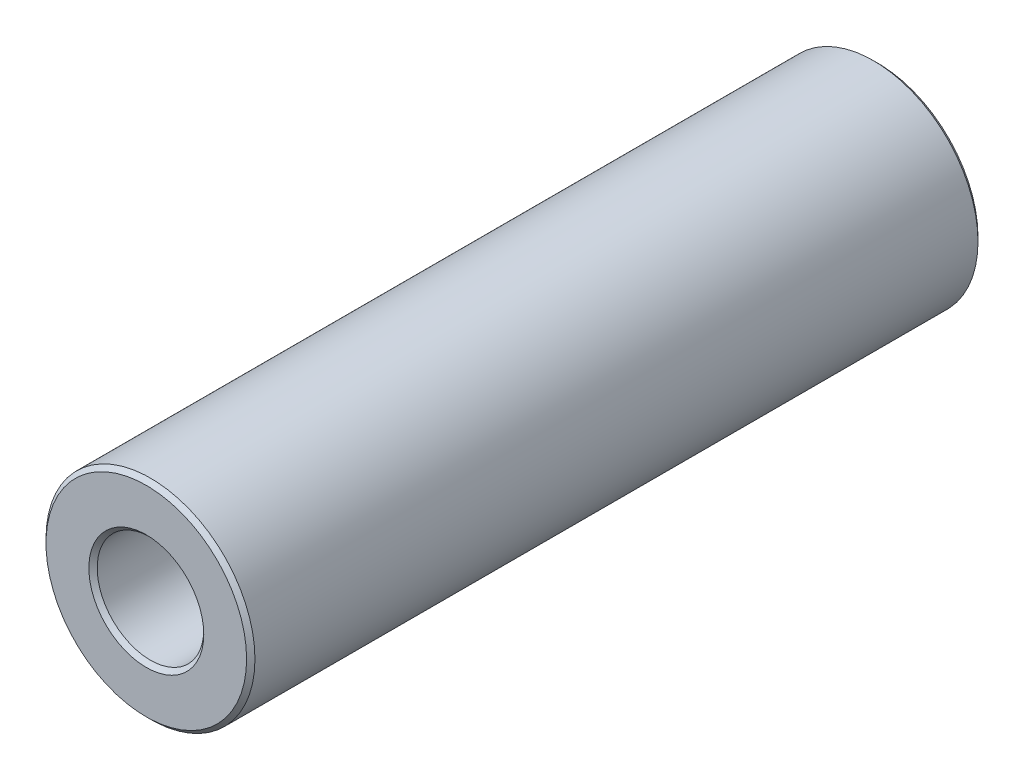
ISO-10303-21;
HEADER;
FILE_DESCRIPTION(('STEP AP214'),'2;1');
FILE_NAME('part.step','',(''),(''),'','','');
FILE_SCHEMA(('AUTOMOTIVE_DESIGN { 1 0 10303 214 1 1 1 1 }'));
ENDSEC;
DATA;
#1=APPLICATION_CONTEXT('core data for automotive mechanical design processes');
#2=APPLICATION_PROTOCOL_DEFINITION('international standard','automotive_design',2000,#1);
#3=PRODUCT_CONTEXT('',#1,'mechanical');
#4=PRODUCT('Part','Part','',(#3));
#5=PRODUCT_RELATED_PRODUCT_CATEGORY('part','',(#4));
#6=PRODUCT_DEFINITION_FORMATION('','',#4);
#7=PRODUCT_DEFINITION_CONTEXT('part definition',#1,'design');
#8=PRODUCT_DEFINITION('design','',#6,#7);
#9=PRODUCT_DEFINITION_SHAPE('','',#8);
#10=(LENGTH_UNIT() NAMED_UNIT(*) SI_UNIT(.MILLI.,.METRE.));
#11=(NAMED_UNIT(*) PLANE_ANGLE_UNIT() SI_UNIT($,.RADIAN.));
#12=(NAMED_UNIT(*) SI_UNIT($,.STERADIAN.) SOLID_ANGLE_UNIT());
#13=UNCERTAINTY_MEASURE_WITH_UNIT(LENGTH_MEASURE(1.E-05),#10,'distance_accuracy_value','');
#14=(GEOMETRIC_REPRESENTATION_CONTEXT(3) GLOBAL_UNCERTAINTY_ASSIGNED_CONTEXT((#13)) GLOBAL_UNIT_ASSIGNED_CONTEXT((#10,
#11,#12)) REPRESENTATION_CONTEXT('',''));
#15=CARTESIAN_POINT('',(0.,0.,0.));
#16=DIRECTION('',(0.,0.,1.));
#17=DIRECTION('',(1.,0.,0.));
#18=AXIS2_PLACEMENT_3D('',#15,#16,#17);
#19=CARTESIAN_POINT('',(0.,0.,35.));
#20=DIRECTION('',(0.,0.,1.));
#21=DIRECTION('',(1.,0.,0.));
#22=AXIS2_PLACEMENT_3D('',#19,#20,#21);
#23=PLANE('',#22);
#24=CARTESIAN_POINT('',(0.,0.,35.));
#25=DIRECTION('',(0.,0.,1.));
#26=DIRECTION('',(1.,0.,0.));
#27=AXIS2_PLACEMENT_3D('',#24,#25,#26);
#28=CIRCLE('',#27,2.75000000000001);
#29=CARTESIAN_POINT('',(2.75000000000001,0.,35.));
#30=VERTEX_POINT('',#29);
#31=EDGE_CURVE('E10',#30,#30,#28,.F.);
#32=ORIENTED_EDGE('',*,*,#31,.T.);
#33=EDGE_LOOP('',(#32));
#34=FACE_BOUND('',#33,.T.);
#35=CARTESIAN_POINT('',(0.,0.,35.));
#36=DIRECTION('',(0.,0.,1.));
#37=DIRECTION('',(1.,0.,0.));
#38=AXIS2_PLACEMENT_3D('',#35,#36,#37);
#39=CIRCLE('',#38,4.79999999999999);
#40=CARTESIAN_POINT('',(4.79999999999999,0.,35.));
#41=VERTEX_POINT('',#40);
#42=EDGE_CURVE('E41',#41,#41,#39,.T.);
#43=ORIENTED_EDGE('',*,*,#42,.T.);
#44=EDGE_LOOP('',(#43));
#45=FACE_BOUND('',#44,.T.);
#46=ADVANCED_FACE('F34',(#34,#45),#23,.T.);
#47=CARTESIAN_POINT('',(0.,0.,0.));
#48=DIRECTION('',(0.,0.,1.));
#49=DIRECTION('',(1.,0.,0.));
#50=AXIS2_PLACEMENT_3D('',#47,#48,#49);
#51=PLANE('',#50);
#52=CARTESIAN_POINT('',(0.,0.,0.));
#53=DIRECTION('',(0.,0.,1.));
#54=DIRECTION('',(1.,0.,0.));
#55=AXIS2_PLACEMENT_3D('',#52,#53,#54);
#56=CIRCLE('',#55,4.8);
#57=CARTESIAN_POINT('',(4.8,0.,0.));
#58=VERTEX_POINT('',#57);
#59=EDGE_CURVE('E54',#58,#58,#56,.F.);
#60=ORIENTED_EDGE('',*,*,#59,.T.);
#61=EDGE_LOOP('',(#60));
#62=FACE_BOUND('',#61,.T.);
#63=CARTESIAN_POINT('',(0.,0.,0.));
#64=DIRECTION('',(0.,0.,1.));
#65=DIRECTION('',(1.,0.,0.));
#66=AXIS2_PLACEMENT_3D('',#63,#64,#65);
#67=CIRCLE('',#66,2.75);
#68=CARTESIAN_POINT('',(2.75,0.,0.));
#69=VERTEX_POINT('',#68);
#70=EDGE_CURVE('E57',#69,#69,#67,.T.);
#71=ORIENTED_EDGE('',*,*,#70,.T.);
#72=EDGE_LOOP('',(#71));
#73=FACE_BOUND('',#72,.T.);
#74=ADVANCED_FACE('F78',(#62,#73),#51,.F.);
#75=CARTESIAN_POINT('',(0.,0.,35.));
#76=DIRECTION('',(0.,0.,-1.));
#77=DIRECTION('',(-1.,0.,0.));
#78=AXIS2_PLACEMENT_3D('',#75,#76,#77);
#79=CYLINDRICAL_SURFACE('',#78,5.);
#80=CARTESIAN_POINT('',(0.,0.,0.199999999999999));
#81=DIRECTION('',(0.,0.,1.));
#82=DIRECTION('',(1.,0.,0.));
#83=AXIS2_PLACEMENT_3D('',#80,#81,#82);
#84=CIRCLE('',#83,5.);
#85=CARTESIAN_POINT('',(5.,0.,0.199999999999999));
#86=VERTEX_POINT('',#85);
#87=EDGE_CURVE('E60',#86,#86,#84,.T.);
#88=ORIENTED_EDGE('',*,*,#87,.T.);
#89=EDGE_LOOP('',(#88));
#90=FACE_BOUND('',#89,.T.);
#91=CARTESIAN_POINT('',(0.,0.,34.8));
#92=DIRECTION('',(0.,0.,1.));
#93=DIRECTION('',(1.,0.,0.));
#94=AXIS2_PLACEMENT_3D('',#91,#92,#93);
#95=CIRCLE('',#94,5.);
#96=CARTESIAN_POINT('',(5.,0.,34.8));
#97=VERTEX_POINT('',#96);
#98=EDGE_CURVE('E63',#97,#97,#95,.F.);
#99=ORIENTED_EDGE('',*,*,#98,.T.);
#100=EDGE_LOOP('',(#99));
#101=FACE_BOUND('',#100,.T.);
#102=ADVANCED_FACE('F67',(#90,#101),#79,.T.);
#103=CARTESIAN_POINT('',(0.,0.,35.));
#104=DIRECTION('',(0.,0.,-1.));
#105=DIRECTION('',(-1.,0.,0.));
#106=AXIS2_PLACEMENT_3D('',#103,#104,#105);
#107=CYLINDRICAL_SURFACE('',#106,2.55);
#108=CARTESIAN_POINT('',(0.,0.,0.199999999999999));
#109=DIRECTION('',(0.,0.,1.));
#110=DIRECTION('',(1.,0.,0.));
#111=AXIS2_PLACEMENT_3D('',#108,#109,#110);
#112=CIRCLE('',#111,2.55);
#113=CARTESIAN_POINT('',(2.55,0.,0.199999999999999));
#114=VERTEX_POINT('',#113);
#115=EDGE_CURVE('E45',#114,#114,#112,.F.);
#116=ORIENTED_EDGE('',*,*,#115,.T.);
#117=EDGE_LOOP('',(#116));
#118=FACE_BOUND('',#117,.T.);
#119=CARTESIAN_POINT('',(0.,0.,34.8));
#120=DIRECTION('',(0.,0.,1.));
#121=DIRECTION('',(1.,0.,0.));
#122=AXIS2_PLACEMENT_3D('',#119,#120,#121);
#123=CIRCLE('',#122,2.55);
#124=CARTESIAN_POINT('',(2.55,0.,34.8));
#125=VERTEX_POINT('',#124);
#126=EDGE_CURVE('E49',#125,#125,#123,.T.);
#127=ORIENTED_EDGE('',*,*,#126,.T.);
#128=EDGE_LOOP('',(#127));
#129=FACE_BOUND('',#128,.T.);
#130=ADVANCED_FACE('F86',(#118,#129),#107,.F.);
#131=CARTESIAN_POINT('',(0.,0.,0.199999999999999));
#132=DIRECTION('',(0.,0.,1.));
#133=DIRECTION('',(1.,0.,0.));
#134=AXIS2_PLACEMENT_3D('',#131,#132,#133);
#135=CONICAL_SURFACE('',#134,5.,0.785398163397446);
#136=ORIENTED_EDGE('',*,*,#59,.F.);
#137=EDGE_LOOP('',(#136));
#138=FACE_BOUND('',#137,.T.);
#139=ORIENTED_EDGE('',*,*,#87,.F.);
#140=EDGE_LOOP('',(#139));
#141=FACE_BOUND('',#140,.T.);
#142=ADVANCED_FACE('F91',(#138,#141),#135,.T.);
#143=CARTESIAN_POINT('',(0.,0.,0.));
#144=DIRECTION('',(0.,0.,-1.));
#145=DIRECTION('',(-1.,0.,0.));
#146=AXIS2_PLACEMENT_3D('',#143,#144,#145);
#147=CONICAL_SURFACE('',#146,2.75,0.785398163397449);
#148=ORIENTED_EDGE('',*,*,#115,.F.);
#149=EDGE_LOOP('',(#148));
#150=FACE_BOUND('',#149,.T.);
#151=ORIENTED_EDGE('',*,*,#70,.F.);
#152=EDGE_LOOP('',(#151));
#153=FACE_BOUND('',#152,.T.);
#154=ADVANCED_FACE('F75',(#150,#153),#147,.F.);
#155=CARTESIAN_POINT('',(0.,0.,34.8));
#156=DIRECTION('',(0.,0.,1.));
#157=DIRECTION('',(1.,0.,0.));
#158=AXIS2_PLACEMENT_3D('',#155,#156,#157);
#159=CONICAL_SURFACE('',#158,2.55,0.785398163397449);
#160=ORIENTED_EDGE('',*,*,#31,.F.);
#161=EDGE_LOOP('',(#160));
#162=FACE_BOUND('',#161,.T.);
#163=ORIENTED_EDGE('',*,*,#126,.F.);
#164=EDGE_LOOP('',(#163));
#165=FACE_BOUND('',#164,.T.);
#166=ADVANCED_FACE('F71',(#162,#165),#159,.F.);
#167=CARTESIAN_POINT('',(0.,0.,35.));
#168=DIRECTION('',(0.,0.,-1.));
#169=DIRECTION('',(-1.,0.,0.));
#170=AXIS2_PLACEMENT_3D('',#167,#168,#169);
#171=CONICAL_SURFACE('',#170,4.79999999999999,0.785398163397472);
#172=ORIENTED_EDGE('',*,*,#98,.F.);
#173=EDGE_LOOP('',(#172));
#174=FACE_BOUND('',#173,.T.);
#175=ORIENTED_EDGE('',*,*,#42,.F.);
#176=EDGE_LOOP('',(#175));
#177=FACE_BOUND('',#176,.T.);
#178=ADVANCED_FACE('F36',(#174,#177),#171,.T.);
#179=CLOSED_SHELL('',(#46,#74,#102,#130,#142,#154,#166,#178));
#180=MANIFOLD_SOLID_BREP('B2',#179);
#181=ADVANCED_BREP_SHAPE_REPRESENTATION('',(#18,#180),#14);
#182=SHAPE_DEFINITION_REPRESENTATION(#9,#181);
ENDSEC;
END-ISO-10303-21;
